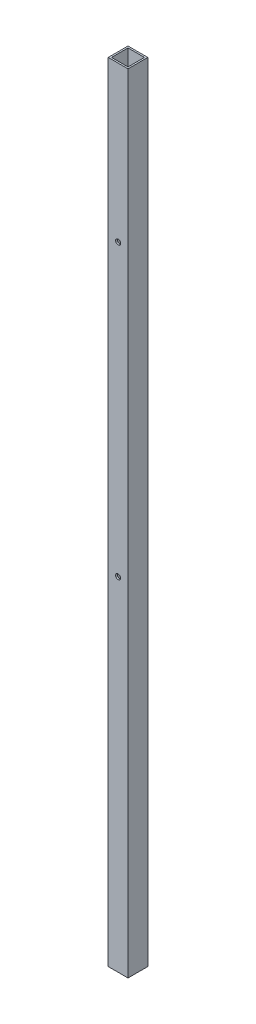
ISO-10303-21;
HEADER;
FILE_DESCRIPTION(('STEP AP214'),'2;1');
FILE_NAME('part.step','',(''),(''),'','','');
FILE_SCHEMA(('AUTOMOTIVE_DESIGN { 1 0 10303 214 1 1 1 1 }'));
ENDSEC;
DATA;
#1=APPLICATION_CONTEXT('core data for automotive mechanical design processes');
#2=APPLICATION_PROTOCOL_DEFINITION('international standard','automotive_design',2000,#1);
#3=PRODUCT_CONTEXT('',#1,'mechanical');
#4=PRODUCT('Part','Part','',(#3));
#5=PRODUCT_RELATED_PRODUCT_CATEGORY('part','',(#4));
#6=PRODUCT_DEFINITION_FORMATION('','',#4);
#7=PRODUCT_DEFINITION_CONTEXT('part definition',#1,'design');
#8=PRODUCT_DEFINITION('design','',#6,#7);
#9=PRODUCT_DEFINITION_SHAPE('','',#8);
#10=(LENGTH_UNIT() NAMED_UNIT(*) SI_UNIT(.MILLI.,.METRE.));
#11=(NAMED_UNIT(*) PLANE_ANGLE_UNIT() SI_UNIT($,.RADIAN.));
#12=(NAMED_UNIT(*) SI_UNIT($,.STERADIAN.) SOLID_ANGLE_UNIT());
#13=UNCERTAINTY_MEASURE_WITH_UNIT(LENGTH_MEASURE(1.E-05),#10,'distance_accuracy_value','');
#14=(GEOMETRIC_REPRESENTATION_CONTEXT(3) GLOBAL_UNCERTAINTY_ASSIGNED_CONTEXT((#13)) GLOBAL_UNIT_ASSIGNED_CONTEXT((#10,
#11,#12)) REPRESENTATION_CONTEXT('',''));
#15=CARTESIAN_POINT('',(0.,0.,0.));
#16=DIRECTION('',(0.,0.,1.));
#17=DIRECTION('',(1.,0.,0.));
#18=AXIS2_PLACEMENT_3D('',#15,#16,#17);
#19=CARTESIAN_POINT('',(0.,379.4633,0.));
#20=DIRECTION('',(0.,1.,0.));
#21=DIRECTION('',(0.,0.,1.));
#22=AXIS2_PLACEMENT_3D('',#19,#20,#21);
#23=PLANE('',#22);
#24=DIRECTION('',(1.,0.,0.));
#25=VECTOR('',#24,1.);
#26=CARTESIAN_POINT('',(9.525,379.4633,9.525));
#27=LINE('',#26,#25);
#28=CARTESIAN_POINT('',(-9.525,379.4633,9.525));
#29=VERTEX_POINT('',#28);
#30=CARTESIAN_POINT('',(9.525,379.4633,9.525));
#31=VERTEX_POINT('',#30);
#32=EDGE_CURVE('E138',#29,#31,#27,.T.);
#33=ORIENTED_EDGE('',*,*,#32,.T.);
#34=DIRECTION('',(0.,0.,-1.));
#35=VECTOR('',#34,1.);
#36=CARTESIAN_POINT('',(9.525,379.4633,-9.525));
#37=LINE('',#36,#35);
#38=CARTESIAN_POINT('',(9.525,379.4633,-9.525));
#39=VERTEX_POINT('',#38);
#40=EDGE_CURVE('E141',#31,#39,#37,.T.);
#41=ORIENTED_EDGE('',*,*,#40,.T.);
#42=DIRECTION('',(-1.,0.,0.));
#43=VECTOR('',#42,1.);
#44=CARTESIAN_POINT('',(9.525,379.4633,-9.525));
#45=LINE('',#44,#43);
#46=CARTESIAN_POINT('',(-9.525,379.4633,-9.525));
#47=VERTEX_POINT('',#46);
#48=EDGE_CURVE('E144',#39,#47,#45,.T.);
#49=ORIENTED_EDGE('',*,*,#48,.T.);
#50=DIRECTION('',(0.,0.,1.));
#51=VECTOR('',#50,1.);
#52=CARTESIAN_POINT('',(-9.525,379.4633,-9.525));
#53=LINE('',#52,#51);
#54=EDGE_CURVE('E146',#47,#29,#53,.T.);
#55=ORIENTED_EDGE('',*,*,#54,.T.);
#56=EDGE_LOOP('',(#33,#41,#49,#55));
#57=FACE_BOUND('',#56,.T.);
#58=DIRECTION('',(0.,0.,-1.));
#59=VECTOR('',#58,1.);
#60=CARTESIAN_POINT('',(7.9375,379.4633,-7.9375));
#61=LINE('',#60,#59);
#62=CARTESIAN_POINT('',(7.9375,379.4633,7.9375));
#63=VERTEX_POINT('',#62);
#64=CARTESIAN_POINT('',(7.9375,379.4633,-7.9375));
#65=VERTEX_POINT('',#64);
#66=EDGE_CURVE('E108',#63,#65,#61,.T.);
#67=ORIENTED_EDGE('',*,*,#66,.F.);
#68=DIRECTION('',(1.,0.,0.));
#69=VECTOR('',#68,1.);
#70=CARTESIAN_POINT('',(7.9375,379.4633,7.9375));
#71=LINE('',#70,#69);
#72=CARTESIAN_POINT('',(-7.9375,379.4633,7.9375));
#73=VERTEX_POINT('',#72);
#74=EDGE_CURVE('E100',#73,#63,#71,.T.);
#75=ORIENTED_EDGE('',*,*,#74,.F.);
#76=DIRECTION('',(0.,0.,1.));
#77=VECTOR('',#76,1.);
#78=CARTESIAN_POINT('',(-7.9375,379.4633,-7.9375));
#79=LINE('',#78,#77);
#80=CARTESIAN_POINT('',(-7.9375,379.4633,-7.9375));
#81=VERTEX_POINT('',#80);
#82=EDGE_CURVE('E122',#81,#73,#79,.T.);
#83=ORIENTED_EDGE('',*,*,#82,.F.);
#84=DIRECTION('',(-1.,0.,0.));
#85=VECTOR('',#84,1.);
#86=CARTESIAN_POINT('',(7.9375,379.4633,-7.9375));
#87=LINE('',#86,#85);
#88=EDGE_CURVE('E120',#65,#81,#87,.T.);
#89=ORIENTED_EDGE('',*,*,#88,.F.);
#90=EDGE_LOOP('',(#67,#75,#83,#89));
#91=FACE_BOUND('',#90,.T.);
#92=ADVANCED_FACE('F35',(#57,#91),#23,.T.);
#93=CARTESIAN_POINT('',(0.,-379.4633,0.));
#94=DIRECTION('',(0.,1.,0.));
#95=DIRECTION('',(0.,0.,1.));
#96=AXIS2_PLACEMENT_3D('',#93,#94,#95);
#97=PLANE('',#96);
#98=DIRECTION('',(1.,0.,0.));
#99=VECTOR('',#98,1.);
#100=CARTESIAN_POINT('',(9.525,-379.4633,9.525));
#101=LINE('',#100,#99);
#102=CARTESIAN_POINT('',(-9.525,-379.4633,9.525));
#103=VERTEX_POINT('',#102);
#104=CARTESIAN_POINT('',(9.525,-379.4633,9.525));
#105=VERTEX_POINT('',#104);
#106=EDGE_CURVE('E116',#103,#105,#101,.T.);
#107=ORIENTED_EDGE('',*,*,#106,.F.);
#108=DIRECTION('',(0.,0.,1.));
#109=VECTOR('',#108,1.);
#110=CARTESIAN_POINT('',(-9.525,-379.4633,-9.525));
#111=LINE('',#110,#109);
#112=CARTESIAN_POINT('',(-9.525,-379.4633,-9.525));
#113=VERTEX_POINT('',#112);
#114=EDGE_CURVE('E142',#113,#103,#111,.T.);
#115=ORIENTED_EDGE('',*,*,#114,.F.);
#116=DIRECTION('',(-1.,0.,0.));
#117=VECTOR('',#116,1.);
#118=CARTESIAN_POINT('',(9.525,-379.4633,-9.525));
#119=LINE('',#118,#117);
#120=CARTESIAN_POINT('',(9.525,-379.4633,-9.525));
#121=VERTEX_POINT('',#120);
#122=EDGE_CURVE('E153',#121,#113,#119,.T.);
#123=ORIENTED_EDGE('',*,*,#122,.F.);
#124=DIRECTION('',(0.,0.,-1.));
#125=VECTOR('',#124,1.);
#126=CARTESIAN_POINT('',(9.525,-379.4633,-9.525));
#127=LINE('',#126,#125);
#128=EDGE_CURVE('E151',#105,#121,#127,.T.);
#129=ORIENTED_EDGE('',*,*,#128,.F.);
#130=EDGE_LOOP('',(#107,#115,#123,#129));
#131=FACE_BOUND('',#130,.T.);
#132=DIRECTION('',(1.,0.,0.));
#133=VECTOR('',#132,1.);
#134=CARTESIAN_POINT('',(7.9375,-379.4633,7.9375));
#135=LINE('',#134,#133);
#136=CARTESIAN_POINT('',(-7.9375,-379.4633,7.9375));
#137=VERTEX_POINT('',#136);
#138=CARTESIAN_POINT('',(7.9375,-379.4633,7.9375));
#139=VERTEX_POINT('',#138);
#140=EDGE_CURVE('E58',#137,#139,#135,.T.);
#141=ORIENTED_EDGE('',*,*,#140,.T.);
#142=DIRECTION('',(0.,0.,-1.));
#143=VECTOR('',#142,1.);
#144=CARTESIAN_POINT('',(7.9375,-379.4633,-7.9375));
#145=LINE('',#144,#143);
#146=CARTESIAN_POINT('',(7.9375,-379.4633,-7.9375));
#147=VERTEX_POINT('',#146);
#148=EDGE_CURVE('E115',#139,#147,#145,.T.);
#149=ORIENTED_EDGE('',*,*,#148,.T.);
#150=DIRECTION('',(-1.,0.,0.));
#151=VECTOR('',#150,1.);
#152=CARTESIAN_POINT('',(7.9375,-379.4633,-7.9375));
#153=LINE('',#152,#151);
#154=CARTESIAN_POINT('',(-7.9375,-379.4633,-7.9375));
#155=VERTEX_POINT('',#154);
#156=EDGE_CURVE('E130',#147,#155,#153,.T.);
#157=ORIENTED_EDGE('',*,*,#156,.T.);
#158=DIRECTION('',(0.,0.,1.));
#159=VECTOR('',#158,1.);
#160=CARTESIAN_POINT('',(-7.9375,-379.4633,-7.9375));
#161=LINE('',#160,#159);
#162=EDGE_CURVE('E109',#155,#137,#161,.T.);
#163=ORIENTED_EDGE('',*,*,#162,.T.);
#164=EDGE_LOOP('',(#141,#149,#157,#163));
#165=FACE_BOUND('',#164,.T.);
#166=ADVANCED_FACE('F171',(#131,#165),#97,.F.);
#167=CARTESIAN_POINT('',(9.525,379.4633,9.525));
#168=DIRECTION('',(0.,0.,-1.));
#169=DIRECTION('',(-1.,0.,0.));
#170=AXIS2_PLACEMENT_3D('',#167,#168,#169);
#171=PLANE('',#170);
#172=CARTESIAN_POINT('',(0.,230.1367,9.525));
#173=DIRECTION('',(0.,0.,1.));
#174=DIRECTION('',(1.,0.,0.));
#175=AXIS2_PLACEMENT_3D('',#172,#173,#174);
#176=CIRCLE('',#175,2.4257);
#177=CARTESIAN_POINT('',(2.4257,230.1367,9.525));
#178=VERTEX_POINT('',#177);
#179=EDGE_CURVE('E216',#178,#178,#176,.T.);
#180=ORIENTED_EDGE('',*,*,#179,.F.);
#181=EDGE_LOOP('',(#180));
#182=FACE_BOUND('',#181,.T.);
#183=CARTESIAN_POINT('',(0.,-49.2633,9.525));
#184=DIRECTION('',(0.,0.,1.));
#185=DIRECTION('',(1.,0.,0.));
#186=AXIS2_PLACEMENT_3D('',#183,#184,#185);
#187=CIRCLE('',#186,2.4257);
#188=CARTESIAN_POINT('',(2.4257,-49.2633,9.525));
#189=VERTEX_POINT('',#188);
#190=EDGE_CURVE('E128',#189,#189,#187,.T.);
#191=ORIENTED_EDGE('',*,*,#190,.F.);
#192=EDGE_LOOP('',(#191));
#193=FACE_BOUND('',#192,.T.);
#194=ORIENTED_EDGE('',*,*,#106,.T.);
#195=DIRECTION('',(0.,-1.,0.));
#196=VECTOR('',#195,1.);
#197=CARTESIAN_POINT('',(9.525,379.4633,9.525));
#198=LINE('',#197,#196);
#199=EDGE_CURVE('E11',#31,#105,#198,.T.);
#200=ORIENTED_EDGE('',*,*,#199,.F.);
#201=ORIENTED_EDGE('',*,*,#32,.F.);
#202=DIRECTION('',(0.,-1.,0.));
#203=VECTOR('',#202,1.);
#204=CARTESIAN_POINT('',(-9.525,379.4633,9.525));
#205=LINE('',#204,#203);
#206=EDGE_CURVE('E148',#29,#103,#205,.T.);
#207=ORIENTED_EDGE('',*,*,#206,.T.);
#208=EDGE_LOOP('',(#194,#200,#201,#207));
#209=FACE_BOUND('',#208,.T.);
#210=ADVANCED_FACE('F37',(#182,#193,#209),#171,.F.);
#211=CARTESIAN_POINT('',(9.525,379.4633,-9.525));
#212=DIRECTION('',(-1.,0.,0.));
#213=DIRECTION('',(0.,0.,1.));
#214=AXIS2_PLACEMENT_3D('',#211,#212,#213);
#215=PLANE('',#214);
#216=ORIENTED_EDGE('',*,*,#128,.T.);
#217=DIRECTION('',(0.,-1.,0.));
#218=VECTOR('',#217,1.);
#219=CARTESIAN_POINT('',(9.525,379.4633,-9.525));
#220=LINE('',#219,#218);
#221=EDGE_CURVE('E43',#39,#121,#220,.T.);
#222=ORIENTED_EDGE('',*,*,#221,.F.);
#223=ORIENTED_EDGE('',*,*,#40,.F.);
#224=ORIENTED_EDGE('',*,*,#199,.T.);
#225=EDGE_LOOP('',(#216,#222,#223,#224));
#226=FACE_BOUND('',#225,.T.);
#227=ADVANCED_FACE('F181',(#226),#215,.F.);
#228=CARTESIAN_POINT('',(9.525,379.4633,-9.525));
#229=DIRECTION('',(0.,0.,1.));
#230=DIRECTION('',(1.,0.,0.));
#231=AXIS2_PLACEMENT_3D('',#228,#229,#230);
#232=PLANE('',#231);
#233=CARTESIAN_POINT('',(0.,-115.8621,-9.525));
#234=DIRECTION('',(0.,0.,-1.));
#235=DIRECTION('',(-1.,0.,0.));
#236=AXIS2_PLACEMENT_3D('',#233,#234,#235);
#237=CIRCLE('',#236,4.7625);
#238=CARTESIAN_POINT('',(-4.7625,-115.8621,-9.525));
#239=VERTEX_POINT('',#238);
#240=EDGE_CURVE('E227',#239,#239,#237,.T.);
#241=ORIENTED_EDGE('',*,*,#240,.F.);
#242=EDGE_LOOP('',(#241));
#243=FACE_BOUND('',#242,.T.);
#244=CARTESIAN_POINT('',(0.,112.3823,-9.525));
#245=DIRECTION('',(0.,0.,-1.));
#246=DIRECTION('',(-1.,0.,0.));
#247=AXIS2_PLACEMENT_3D('',#244,#245,#246);
#248=CIRCLE('',#247,4.7625);
#249=CARTESIAN_POINT('',(-4.7625,112.3823,-9.525));
#250=VERTEX_POINT('',#249);
#251=EDGE_CURVE('E223',#250,#250,#248,.T.);
#252=ORIENTED_EDGE('',*,*,#251,.F.);
#253=EDGE_LOOP('',(#252));
#254=FACE_BOUND('',#253,.T.);
#255=ORIENTED_EDGE('',*,*,#122,.T.);
#256=DIRECTION('',(0.,-1.,0.));
#257=VECTOR('',#256,1.);
#258=CARTESIAN_POINT('',(-9.525,379.4633,-9.525));
#259=LINE('',#258,#257);
#260=EDGE_CURVE('E158',#47,#113,#259,.T.);
#261=ORIENTED_EDGE('',*,*,#260,.F.);
#262=ORIENTED_EDGE('',*,*,#48,.F.);
#263=ORIENTED_EDGE('',*,*,#221,.T.);
#264=EDGE_LOOP('',(#255,#261,#262,#263));
#265=FACE_BOUND('',#264,.T.);
#266=ADVANCED_FACE('F165',(#243,#254,#265),#232,.F.);
#267=CARTESIAN_POINT('',(-9.525,379.4633,-9.525));
#268=DIRECTION('',(1.,0.,0.));
#269=DIRECTION('',(0.,0.,-1.));
#270=AXIS2_PLACEMENT_3D('',#267,#268,#269);
#271=PLANE('',#270);
#272=ORIENTED_EDGE('',*,*,#114,.T.);
#273=ORIENTED_EDGE('',*,*,#206,.F.);
#274=ORIENTED_EDGE('',*,*,#54,.F.);
#275=ORIENTED_EDGE('',*,*,#260,.T.);
#276=EDGE_LOOP('',(#272,#273,#274,#275));
#277=FACE_BOUND('',#276,.T.);
#278=ADVANCED_FACE('F175',(#277),#271,.F.);
#279=CARTESIAN_POINT('',(7.9375,379.4633,7.9375));
#280=DIRECTION('',(0.,0.,-1.));
#281=DIRECTION('',(-1.,0.,0.));
#282=AXIS2_PLACEMENT_3D('',#279,#280,#281);
#283=PLANE('',#282);
#284=CARTESIAN_POINT('',(0.,230.1367,7.9375));
#285=DIRECTION('',(0.,0.,-1.));
#286=DIRECTION('',(-1.,0.,0.));
#287=AXIS2_PLACEMENT_3D('',#284,#285,#286);
#288=CIRCLE('',#287,2.4257);
#289=CARTESIAN_POINT('',(-2.4257,230.1367,7.9375));
#290=VERTEX_POINT('',#289);
#291=EDGE_CURVE('E211',#290,#290,#288,.F.);
#292=ORIENTED_EDGE('',*,*,#291,.T.);
#293=EDGE_LOOP('',(#292));
#294=FACE_BOUND('',#293,.T.);
#295=CARTESIAN_POINT('',(0.,-49.2633,7.9375));
#296=DIRECTION('',(0.,0.,-1.));
#297=DIRECTION('',(-1.,0.,0.));
#298=AXIS2_PLACEMENT_3D('',#295,#296,#297);
#299=CIRCLE('',#298,2.4257);
#300=CARTESIAN_POINT('',(-2.4257,-49.2633,7.9375));
#301=VERTEX_POINT('',#300);
#302=EDGE_CURVE('E214',#301,#301,#299,.F.);
#303=ORIENTED_EDGE('',*,*,#302,.T.);
#304=EDGE_LOOP('',(#303));
#305=FACE_BOUND('',#304,.T.);
#306=ORIENTED_EDGE('',*,*,#140,.F.);
#307=DIRECTION('',(0.,-1.,0.));
#308=VECTOR('',#307,1.);
#309=CARTESIAN_POINT('',(-7.9375,379.4633,7.9375));
#310=LINE('',#309,#308);
#311=EDGE_CURVE('E104',#73,#137,#310,.T.);
#312=ORIENTED_EDGE('',*,*,#311,.F.);
#313=ORIENTED_EDGE('',*,*,#74,.T.);
#314=DIRECTION('',(0.,-1.,0.));
#315=VECTOR('',#314,1.);
#316=CARTESIAN_POINT('',(7.9375,379.4633,7.9375));
#317=LINE('',#316,#315);
#318=EDGE_CURVE('E103',#63,#139,#317,.T.);
#319=ORIENTED_EDGE('',*,*,#318,.T.);
#320=EDGE_LOOP('',(#306,#312,#313,#319));
#321=FACE_BOUND('',#320,.T.);
#322=ADVANCED_FACE('F102',(#294,#305,#321),#283,.T.);
#323=CARTESIAN_POINT('',(7.9375,379.4633,-7.9375));
#324=DIRECTION('',(-1.,0.,0.));
#325=DIRECTION('',(0.,0.,1.));
#326=AXIS2_PLACEMENT_3D('',#323,#324,#325);
#327=PLANE('',#326);
#328=ORIENTED_EDGE('',*,*,#148,.F.);
#329=ORIENTED_EDGE('',*,*,#318,.F.);
#330=ORIENTED_EDGE('',*,*,#66,.T.);
#331=DIRECTION('',(0.,-1.,0.));
#332=VECTOR('',#331,1.);
#333=CARTESIAN_POINT('',(7.9375,379.4633,-7.9375));
#334=LINE('',#333,#332);
#335=EDGE_CURVE('E117',#65,#147,#334,.T.);
#336=ORIENTED_EDGE('',*,*,#335,.T.);
#337=EDGE_LOOP('',(#328,#329,#330,#336));
#338=FACE_BOUND('',#337,.T.);
#339=ADVANCED_FACE('F112',(#338),#327,.T.);
#340=CARTESIAN_POINT('',(7.9375,379.4633,-7.9375));
#341=DIRECTION('',(0.,0.,1.));
#342=DIRECTION('',(1.,0.,0.));
#343=AXIS2_PLACEMENT_3D('',#340,#341,#342);
#344=PLANE('',#343);
#345=CARTESIAN_POINT('',(0.,-115.8621,-7.9375));
#346=DIRECTION('',(0.,0.,1.));
#347=DIRECTION('',(1.,0.,0.));
#348=AXIS2_PLACEMENT_3D('',#345,#346,#347);
#349=CIRCLE('',#348,4.7625);
#350=CARTESIAN_POINT('',(4.7625,-115.8621,-7.93750000000001));
#351=VERTEX_POINT('',#350);
#352=EDGE_CURVE('E230',#351,#351,#349,.F.);
#353=ORIENTED_EDGE('',*,*,#352,.T.);
#354=EDGE_LOOP('',(#353));
#355=FACE_BOUND('',#354,.T.);
#356=CARTESIAN_POINT('',(0.,112.3823,-7.9375));
#357=DIRECTION('',(0.,0.,1.));
#358=DIRECTION('',(1.,0.,0.));
#359=AXIS2_PLACEMENT_3D('',#356,#357,#358);
#360=CIRCLE('',#359,4.7625);
#361=CARTESIAN_POINT('',(4.7625,112.3823,-7.93750000000001));
#362=VERTEX_POINT('',#361);
#363=EDGE_CURVE('E224',#362,#362,#360,.F.);
#364=ORIENTED_EDGE('',*,*,#363,.T.);
#365=EDGE_LOOP('',(#364));
#366=FACE_BOUND('',#365,.T.);
#367=ORIENTED_EDGE('',*,*,#156,.F.);
#368=ORIENTED_EDGE('',*,*,#335,.F.);
#369=ORIENTED_EDGE('',*,*,#88,.T.);
#370=DIRECTION('',(0.,-1.,0.));
#371=VECTOR('',#370,1.);
#372=CARTESIAN_POINT('',(-7.9375,379.4633,-7.9375));
#373=LINE('',#372,#371);
#374=EDGE_CURVE('E50',#81,#155,#373,.T.);
#375=ORIENTED_EDGE('',*,*,#374,.T.);
#376=EDGE_LOOP('',(#367,#368,#369,#375));
#377=FACE_BOUND('',#376,.T.);
#378=ADVANCED_FACE('F207',(#355,#366,#377),#344,.T.);
#379=CARTESIAN_POINT('',(-7.9375,379.4633,-7.9375));
#380=DIRECTION('',(1.,0.,0.));
#381=DIRECTION('',(0.,0.,-1.));
#382=AXIS2_PLACEMENT_3D('',#379,#380,#381);
#383=PLANE('',#382);
#384=ORIENTED_EDGE('',*,*,#162,.F.);
#385=ORIENTED_EDGE('',*,*,#374,.F.);
#386=ORIENTED_EDGE('',*,*,#82,.T.);
#387=ORIENTED_EDGE('',*,*,#311,.T.);
#388=EDGE_LOOP('',(#384,#385,#386,#387));
#389=FACE_BOUND('',#388,.T.);
#390=ADVANCED_FACE('F258',(#389),#383,.T.);
#391=CARTESIAN_POINT('',(0.,-49.2633,-9.526));
#392=DIRECTION('',(0.,0.,1.));
#393=DIRECTION('',(1.,0.,0.));
#394=AXIS2_PLACEMENT_3D('',#391,#392,#393);
#395=CYLINDRICAL_SURFACE('',#394,2.4257);
#396=ORIENTED_EDGE('',*,*,#302,.F.);
#397=EDGE_LOOP('',(#396));
#398=FACE_BOUND('',#397,.T.);
#399=ORIENTED_EDGE('',*,*,#190,.T.);
#400=EDGE_LOOP('',(#399));
#401=FACE_BOUND('',#400,.T.);
#402=ADVANCED_FACE('F251',(#398,#401),#395,.F.);
#403=CARTESIAN_POINT('',(0.,230.1367,-9.526));
#404=DIRECTION('',(0.,0.,1.));
#405=DIRECTION('',(1.,0.,0.));
#406=AXIS2_PLACEMENT_3D('',#403,#404,#405);
#407=CYLINDRICAL_SURFACE('',#406,2.4257);
#408=ORIENTED_EDGE('',*,*,#291,.F.);
#409=EDGE_LOOP('',(#408));
#410=FACE_BOUND('',#409,.T.);
#411=ORIENTED_EDGE('',*,*,#179,.T.);
#412=EDGE_LOOP('',(#411));
#413=FACE_BOUND('',#412,.T.);
#414=ADVANCED_FACE('F242',(#410,#413),#407,.F.);
#415=CARTESIAN_POINT('',(0.,112.3823,9.52600000000001));
#416=DIRECTION('',(0.,0.,-1.));
#417=DIRECTION('',(-1.,0.,0.));
#418=AXIS2_PLACEMENT_3D('',#415,#416,#417);
#419=CYLINDRICAL_SURFACE('',#418,4.7625);
#420=ORIENTED_EDGE('',*,*,#363,.F.);
#421=EDGE_LOOP('',(#420));
#422=FACE_BOUND('',#421,.T.);
#423=ORIENTED_EDGE('',*,*,#251,.T.);
#424=EDGE_LOOP('',(#423));
#425=FACE_BOUND('',#424,.T.);
#426=ADVANCED_FACE('F240',(#422,#425),#419,.F.);
#427=CARTESIAN_POINT('',(0.,-115.8621,9.52600000000001));
#428=DIRECTION('',(0.,0.,-1.));
#429=DIRECTION('',(-1.,0.,0.));
#430=AXIS2_PLACEMENT_3D('',#427,#428,#429);
#431=CYLINDRICAL_SURFACE('',#430,4.7625);
#432=ORIENTED_EDGE('',*,*,#352,.F.);
#433=EDGE_LOOP('',(#432));
#434=FACE_BOUND('',#433,.T.);
#435=ORIENTED_EDGE('',*,*,#240,.T.);
#436=EDGE_LOOP('',(#435));
#437=FACE_BOUND('',#436,.T.);
#438=ADVANCED_FACE('F236',(#434,#437),#431,.F.);
#439=CLOSED_SHELL('',(#92,#166,#210,#227,#266,#278,#322,#339,#378,#390,#402,#414,#426,#438));
#440=MANIFOLD_SOLID_BREP('B2',#439);
#441=ADVANCED_BREP_SHAPE_REPRESENTATION('',(#18,#440),#14);
#442=SHAPE_DEFINITION_REPRESENTATION(#9,#441);
ENDSEC;
END-ISO-10303-21;
